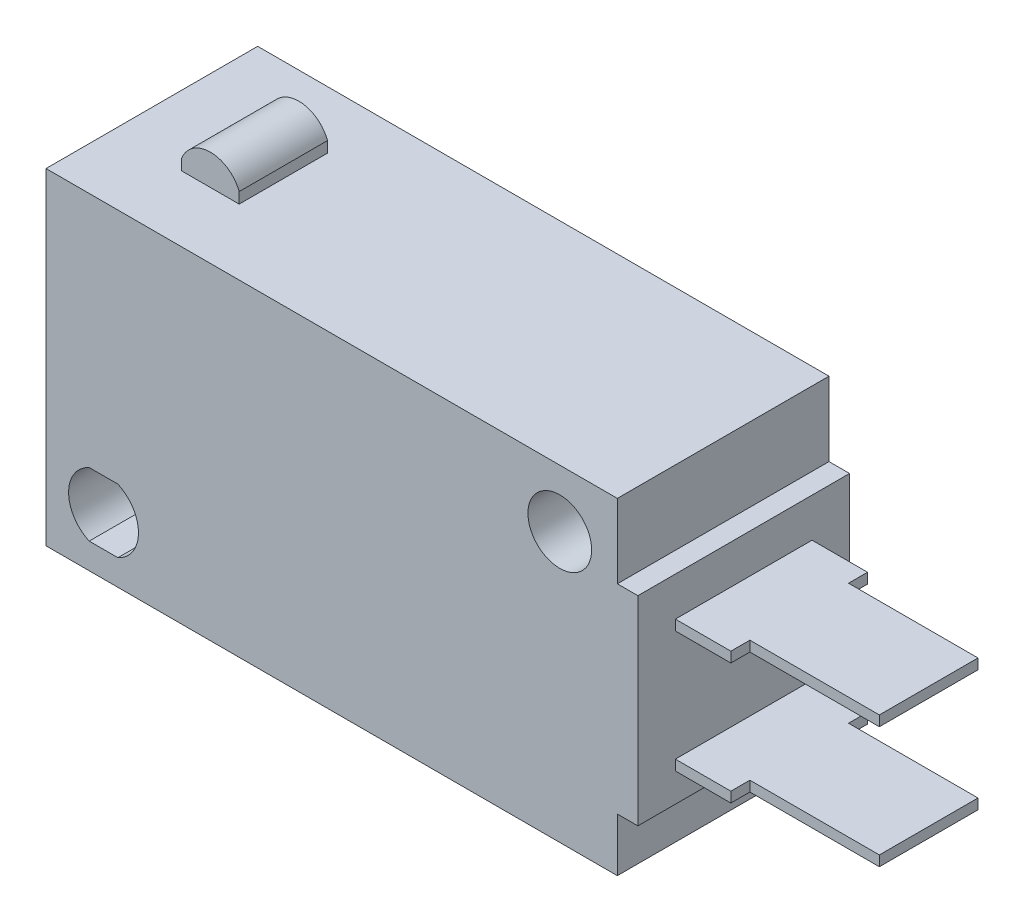
ISO-10303-21;
HEADER;
FILE_DESCRIPTION(('STEP AP214'),'2;1');
FILE_NAME('part.step','',(''),(''),'','','');
FILE_SCHEMA(('AUTOMOTIVE_DESIGN { 1 0 10303 214 1 1 1 1 }'));
ENDSEC;
DATA;
#1=APPLICATION_CONTEXT('core data for automotive mechanical design processes');
#2=APPLICATION_PROTOCOL_DEFINITION('international standard','automotive_design',2000,#1);
#3=PRODUCT_CONTEXT('',#1,'mechanical');
#4=PRODUCT('Part','Part','',(#3));
#5=PRODUCT_RELATED_PRODUCT_CATEGORY('part','',(#4));
#6=PRODUCT_DEFINITION_FORMATION('','',#4);
#7=PRODUCT_DEFINITION_CONTEXT('part definition',#1,'design');
#8=PRODUCT_DEFINITION('design','',#6,#7);
#9=PRODUCT_DEFINITION_SHAPE('','',#8);
#10=(LENGTH_UNIT() NAMED_UNIT(*) SI_UNIT(.MILLI.,.METRE.));
#11=(NAMED_UNIT(*) PLANE_ANGLE_UNIT() SI_UNIT($,.RADIAN.));
#12=(NAMED_UNIT(*) SI_UNIT($,.STERADIAN.) SOLID_ANGLE_UNIT());
#13=UNCERTAINTY_MEASURE_WITH_UNIT(LENGTH_MEASURE(1.E-05),#10,'distance_accuracy_value','');
#14=(GEOMETRIC_REPRESENTATION_CONTEXT(3) GLOBAL_UNCERTAINTY_ASSIGNED_CONTEXT((#13)) GLOBAL_UNIT_ASSIGNED_CONTEXT((#10,
#11,#12)) REPRESENTATION_CONTEXT('',''));
#15=CARTESIAN_POINT('',(0.,0.,0.));
#16=DIRECTION('',(0.,0.,1.));
#17=DIRECTION('',(1.,0.,0.));
#18=AXIS2_PLACEMENT_3D('',#15,#16,#17);
#19=CARTESIAN_POINT('',(3.8,-0.8,5.15));
#20=DIRECTION('',(-1.,0.,0.));
#21=DIRECTION('',(0.,-1.,0.));
#22=AXIS2_PLACEMENT_3D('',#19,#20,#21);
#23=PLANE('',#22);
#24=DIRECTION('',(0.,-1.,0.));
#25=VECTOR('',#24,1.);
#26=CARTESIAN_POINT('',(3.8,-2.7,3.325));
#27=LINE('',#26,#25);
#28=CARTESIAN_POINT('',(3.8,-2.7,3.325));
#29=VERTEX_POINT('',#28);
#30=CARTESIAN_POINT('',(3.8,-3.2,3.325));
#31=VERTEX_POINT('',#30);
#32=EDGE_CURVE('E393',#29,#31,#27,.T.);
#33=ORIENTED_EDGE('',*,*,#32,.F.);
#34=DIRECTION('',(0.,0.,1.));
#35=VECTOR('',#34,1.);
#36=CARTESIAN_POINT('',(3.8,-2.7,3.325));
#37=LINE('',#36,#35);
#38=CARTESIAN_POINT('',(3.8,-2.7,-3.325));
#39=VERTEX_POINT('',#38);
#40=EDGE_CURVE('E402',#39,#29,#37,.T.);
#41=ORIENTED_EDGE('',*,*,#40,.F.);
#42=DIRECTION('',(0.,1.,0.));
#43=VECTOR('',#42,1.);
#44=CARTESIAN_POINT('',(3.8,-2.7,-3.325));
#45=LINE('',#44,#43);
#46=CARTESIAN_POINT('',(3.8,-3.2,-3.325));
#47=VERTEX_POINT('',#46);
#48=EDGE_CURVE('E399',#47,#39,#45,.T.);
#49=ORIENTED_EDGE('',*,*,#48,.F.);
#50=DIRECTION('',(0.,0.,-1.));
#51=VECTOR('',#50,1.);
#52=CARTESIAN_POINT('',(3.8,-3.2,3.325));
#53=LINE('',#52,#51);
#54=EDGE_CURVE('E396',#31,#47,#53,.T.);
#55=ORIENTED_EDGE('',*,*,#54,.F.);
#56=EDGE_LOOP('',(#33,#41,#49,#55));
#57=FACE_BOUND('',#56,.T.);
#58=DIRECTION('',(0.,1.,0.));
#59=VECTOR('',#58,1.);
#60=CARTESIAN_POINT('',(3.8,-0.8,-5.15));
#61=LINE('',#60,#59);
#62=CARTESIAN_POINT('',(3.8,-10.5,-5.15));
#63=VERTEX_POINT('',#62);
#64=CARTESIAN_POINT('',(3.8,-0.8,-5.15));
#65=VERTEX_POINT('',#64);
#66=EDGE_CURVE('E298',#63,#65,#61,.T.);
#67=ORIENTED_EDGE('',*,*,#66,.T.);
#68=DIRECTION('',(0.,0.,-1.));
#69=VECTOR('',#68,1.);
#70=CARTESIAN_POINT('',(3.8,-0.8,5.15));
#71=LINE('',#70,#69);
#72=CARTESIAN_POINT('',(3.8,-0.8,5.15));
#73=VERTEX_POINT('',#72);
#74=EDGE_CURVE('E332',#73,#65,#71,.T.);
#75=ORIENTED_EDGE('',*,*,#74,.F.);
#76=DIRECTION('',(0.,1.,0.));
#77=VECTOR('',#76,1.);
#78=CARTESIAN_POINT('',(3.8,-0.8,5.15));
#79=LINE('',#78,#77);
#80=CARTESIAN_POINT('',(3.8,-10.5,5.15));
#81=VERTEX_POINT('',#80);
#82=EDGE_CURVE('E315',#81,#73,#79,.T.);
#83=ORIENTED_EDGE('',*,*,#82,.F.);
#84=DIRECTION('',(0.,0.,-1.));
#85=VECTOR('',#84,1.);
#86=CARTESIAN_POINT('',(3.8,-10.5,5.15));
#87=LINE('',#86,#85);
#88=EDGE_CURVE('E335',#81,#63,#87,.T.);
#89=ORIENTED_EDGE('',*,*,#88,.T.);
#90=EDGE_LOOP('',(#67,#75,#83,#89));
#91=FACE_BOUND('',#90,.T.);
#92=DIRECTION('',(0.,-1.,0.));
#93=VECTOR('',#92,1.);
#94=CARTESIAN_POINT('',(3.8,-8.6,3.325));
#95=LINE('',#94,#93);
#96=CARTESIAN_POINT('',(3.8,-8.6,3.325));
#97=VERTEX_POINT('',#96);
#98=CARTESIAN_POINT('',(3.8,-9.1,3.325));
#99=VERTEX_POINT('',#98);
#100=EDGE_CURVE('E917',#97,#99,#95,.T.);
#101=ORIENTED_EDGE('',*,*,#100,.F.);
#102=DIRECTION('',(0.,0.,1.));
#103=VECTOR('',#102,1.);
#104=CARTESIAN_POINT('',(3.8,-8.6,3.325));
#105=LINE('',#104,#103);
#106=CARTESIAN_POINT('',(3.8,-8.6,-3.325));
#107=VERTEX_POINT('',#106);
#108=EDGE_CURVE('E377',#107,#97,#105,.T.);
#109=ORIENTED_EDGE('',*,*,#108,.F.);
#110=DIRECTION('',(0.,1.,0.));
#111=VECTOR('',#110,1.);
#112=CARTESIAN_POINT('',(3.8,-8.6,-3.325));
#113=LINE('',#112,#111);
#114=CARTESIAN_POINT('',(3.8,-9.1,-3.325));
#115=VERTEX_POINT('',#114);
#116=EDGE_CURVE('E382',#115,#107,#113,.T.);
#117=ORIENTED_EDGE('',*,*,#116,.F.);
#118=DIRECTION('',(0.,0.,-1.));
#119=VECTOR('',#118,1.);
#120=CARTESIAN_POINT('',(3.8,-9.1,3.325));
#121=LINE('',#120,#119);
#122=EDGE_CURVE('E920',#99,#115,#121,.T.);
#123=ORIENTED_EDGE('',*,*,#122,.F.);
#124=EDGE_LOOP('',(#101,#109,#117,#123));
#125=FACE_BOUND('',#124,.T.);
#126=ADVANCED_FACE('F15',(#57,#91,#125),#23,.F.);
#127=CARTESIAN_POINT('',(-25.,2.8,5.15));
#128=DIRECTION('',(0.,-1.,0.));
#129=DIRECTION('',(0.,0.,-1.));
#130=AXIS2_PLACEMENT_3D('',#127,#128,#129);
#131=PLANE('',#130);
#132=DIRECTION('',(-1.,0.,0.));
#133=VECTOR('',#132,1.);
#134=CARTESIAN_POINT('',(-25.,2.8,-5.15));
#135=LINE('',#134,#133);
#136=CARTESIAN_POINT('',(2.8,2.8,-5.15));
#137=VERTEX_POINT('',#136);
#138=CARTESIAN_POINT('',(-25.,2.8,-5.15));
#139=VERTEX_POINT('',#138);
#140=EDGE_CURVE('E304',#137,#139,#135,.T.);
#141=ORIENTED_EDGE('',*,*,#140,.T.);
#142=DIRECTION('',(0.,0.,-1.));
#143=VECTOR('',#142,1.);
#144=CARTESIAN_POINT('',(-25.,2.8,5.15));
#145=LINE('',#144,#143);
#146=CARTESIAN_POINT('',(-25.,2.8,5.15));
#147=VERTEX_POINT('',#146);
#148=EDGE_CURVE('E323',#147,#139,#145,.T.);
#149=ORIENTED_EDGE('',*,*,#148,.F.);
#150=DIRECTION('',(-1.,0.,0.));
#151=VECTOR('',#150,1.);
#152=CARTESIAN_POINT('',(-25.,2.8,5.15));
#153=LINE('',#152,#151);
#154=CARTESIAN_POINT('',(2.8,2.8,5.15));
#155=VERTEX_POINT('',#154);
#156=EDGE_CURVE('E321',#155,#147,#153,.T.);
#157=ORIENTED_EDGE('',*,*,#156,.F.);
#158=DIRECTION('',(0.,0.,-1.));
#159=VECTOR('',#158,1.);
#160=CARTESIAN_POINT('',(2.8,2.8,5.15));
#161=LINE('',#160,#159);
#162=EDGE_CURVE('E326',#155,#137,#161,.T.);
#163=ORIENTED_EDGE('',*,*,#162,.T.);
#164=EDGE_LOOP('',(#141,#149,#157,#163));
#165=FACE_BOUND('',#164,.T.);
#166=DIRECTION('',(0.,0.,1.));
#167=VECTOR('',#166,1.);
#168=CARTESIAN_POINT('',(-21.6,2.8,-2.35));
#169=LINE('',#168,#167);
#170=CARTESIAN_POINT('',(-21.6,2.8,-2.35));
#171=VERTEX_POINT('',#170);
#172=CARTESIAN_POINT('',(-21.6,2.8,1.95));
#173=VERTEX_POINT('',#172);
#174=EDGE_CURVE('E418',#171,#173,#169,.T.);
#175=ORIENTED_EDGE('',*,*,#174,.F.);
#176=DIRECTION('',(-1.,0.,0.));
#177=VECTOR('',#176,1.);
#178=CARTESIAN_POINT('',(-21.6,2.8,-2.35));
#179=LINE('',#178,#177);
#180=CARTESIAN_POINT('',(-18.8,2.8,-2.35));
#181=VERTEX_POINT('',#180);
#182=EDGE_CURVE('E424',#181,#171,#179,.T.);
#183=ORIENTED_EDGE('',*,*,#182,.F.);
#184=DIRECTION('',(0.,0.,-1.));
#185=VECTOR('',#184,1.);
#186=CARTESIAN_POINT('',(-18.8,2.8,-2.35));
#187=LINE('',#186,#185);
#188=CARTESIAN_POINT('',(-18.8,2.8,1.95));
#189=VERTEX_POINT('',#188);
#190=EDGE_CURVE('E422',#189,#181,#187,.T.);
#191=ORIENTED_EDGE('',*,*,#190,.F.);
#192=DIRECTION('',(1.,0.,0.));
#193=VECTOR('',#192,1.);
#194=CARTESIAN_POINT('',(-21.6,2.8,1.95));
#195=LINE('',#194,#193);
#196=EDGE_CURVE('E244',#173,#189,#195,.T.);
#197=ORIENTED_EDGE('',*,*,#196,.F.);
#198=EDGE_LOOP('',(#175,#183,#191,#197));
#199=FACE_BOUND('',#198,.T.);
#200=ADVANCED_FACE('F431',(#165,#199),#131,.F.);
#201=CARTESIAN_POINT('',(-25.,-13.1,5.15));
#202=DIRECTION('',(0.,0.,1.));
#203=DIRECTION('',(1.,0.,0.));
#204=AXIS2_PLACEMENT_3D('',#201,#202,#203);
#205=PLANE('',#204);
#206=CARTESIAN_POINT('',(0.,0.,5.15));
#207=DIRECTION('',(0.,0.,1.));
#208=DIRECTION('',(1.,0.,0.));
#209=AXIS2_PLACEMENT_3D('',#206,#207,#208);
#210=CIRCLE('',#209,1.55);
#211=CARTESIAN_POINT('',(1.55,0.,5.15));
#212=VERTEX_POINT('',#211);
#213=EDGE_CURVE('E286',#212,#212,#210,.T.);
#214=ORIENTED_EDGE('',*,*,#213,.F.);
#215=EDGE_LOOP('',(#214));
#216=FACE_BOUND('',#215,.T.);
#217=DIRECTION('',(0.,-1.,0.));
#218=VECTOR('',#217,1.);
#219=CARTESIAN_POINT('',(-25.,2.8,5.15));
#220=LINE('',#219,#218);
#221=CARTESIAN_POINT('',(-25.,-13.1,5.15));
#222=VERTEX_POINT('',#221);
#223=EDGE_CURVE('E306',#147,#222,#220,.T.);
#224=ORIENTED_EDGE('',*,*,#223,.T.);
#225=DIRECTION('',(1.,0.,0.));
#226=VECTOR('',#225,1.);
#227=CARTESIAN_POINT('',(-25.,-13.1,5.15));
#228=LINE('',#227,#226);
#229=CARTESIAN_POINT('',(2.8,-13.1,5.15));
#230=VERTEX_POINT('',#229);
#231=EDGE_CURVE('E309',#222,#230,#228,.T.);
#232=ORIENTED_EDGE('',*,*,#231,.T.);
#233=DIRECTION('',(0.,1.,0.));
#234=VECTOR('',#233,1.);
#235=CARTESIAN_POINT('',(2.8,-10.5,5.15));
#236=LINE('',#235,#234);
#237=CARTESIAN_POINT('',(2.8,-10.5,5.15));
#238=VERTEX_POINT('',#237);
#239=EDGE_CURVE('E311',#230,#238,#236,.T.);
#240=ORIENTED_EDGE('',*,*,#239,.T.);
#241=DIRECTION('',(1.,0.,0.));
#242=VECTOR('',#241,1.);
#243=CARTESIAN_POINT('',(3.8,-10.5,5.15));
#244=LINE('',#243,#242);
#245=EDGE_CURVE('E313',#238,#81,#244,.T.);
#246=ORIENTED_EDGE('',*,*,#245,.T.);
#247=ORIENTED_EDGE('',*,*,#82,.T.);
#248=DIRECTION('',(-1.,0.,0.));
#249=VECTOR('',#248,1.);
#250=CARTESIAN_POINT('',(2.8,-0.8,5.15));
#251=LINE('',#250,#249);
#252=CARTESIAN_POINT('',(2.8,-0.8,5.15));
#253=VERTEX_POINT('',#252);
#254=EDGE_CURVE('E317',#73,#253,#251,.T.);
#255=ORIENTED_EDGE('',*,*,#254,.T.);
#256=DIRECTION('',(0.,1.,0.));
#257=VECTOR('',#256,1.);
#258=CARTESIAN_POINT('',(2.8,2.8,5.15));
#259=LINE('',#258,#257);
#260=EDGE_CURVE('E319',#253,#155,#259,.T.);
#261=ORIENTED_EDGE('',*,*,#260,.T.);
#262=ORIENTED_EDGE('',*,*,#156,.T.);
#263=EDGE_LOOP('',(#224,#232,#240,#246,#247,#255,#261,#262));
#264=FACE_BOUND('',#263,.T.);
#265=DIRECTION('',(1.,0.,0.));
#266=VECTOR('',#265,1.);
#267=CARTESIAN_POINT('',(-22.8982120021885,-11.85,5.15));
#268=LINE('',#267,#266);
#269=CARTESIAN_POINT('',(-22.8982120021885,-11.85,5.15));
#270=VERTEX_POINT('',#269);
#271=CARTESIAN_POINT('',(-21.5017879978116,-11.85,5.15));
#272=VERTEX_POINT('',#271);
#273=EDGE_CURVE('E266',#270,#272,#268,.T.);
#274=ORIENTED_EDGE('',*,*,#273,.F.);
#275=CARTESIAN_POINT('',(-22.2,-10.3,5.15));
#276=DIRECTION('',(0.,0.,1.));
#277=DIRECTION('',(1.,0.,0.));
#278=AXIS2_PLACEMENT_3D('',#275,#276,#277);
#279=CIRCLE('',#278,1.7);
#280=CARTESIAN_POINT('',(-22.8982120021885,-8.75,5.15));
#281=VERTEX_POINT('',#280);
#282=EDGE_CURVE('E264',#281,#270,#279,.T.);
#283=ORIENTED_EDGE('',*,*,#282,.F.);
#284=DIRECTION('',(-1.,0.,0.));
#285=VECTOR('',#284,1.);
#286=CARTESIAN_POINT('',(-22.8982120021885,-8.75,5.15));
#287=LINE('',#286,#285);
#288=CARTESIAN_POINT('',(-21.5017879978116,-8.75,5.15));
#289=VERTEX_POINT('',#288);
#290=EDGE_CURVE('E271',#289,#281,#287,.T.);
#291=ORIENTED_EDGE('',*,*,#290,.F.);
#292=CARTESIAN_POINT('',(-22.2,-10.3,5.15));
#293=DIRECTION('',(0.,0.,1.));
#294=DIRECTION('',(1.,0.,0.));
#295=AXIS2_PLACEMENT_3D('',#292,#293,#294);
#296=CIRCLE('',#295,1.7);
#297=EDGE_CURVE('E268',#272,#289,#296,.T.);
#298=ORIENTED_EDGE('',*,*,#297,.F.);
#299=EDGE_LOOP('',(#274,#283,#291,#298));
#300=FACE_BOUND('',#299,.T.);
#301=ADVANCED_FACE('F451',(#216,#264,#300),#205,.T.);
#302=CARTESIAN_POINT('',(-25.,-13.1,-5.15));
#303=DIRECTION('',(0.,0.,1.));
#304=DIRECTION('',(1.,0.,0.));
#305=AXIS2_PLACEMENT_3D('',#302,#303,#304);
#306=PLANE('',#305);
#307=CARTESIAN_POINT('',(0.,0.,-5.15));
#308=DIRECTION('',(0.,0.,1.));
#309=DIRECTION('',(1.,0.,0.));
#310=AXIS2_PLACEMENT_3D('',#307,#308,#309);
#311=CIRCLE('',#310,1.55);
#312=CARTESIAN_POINT('',(1.55,0.,-5.15));
#313=VERTEX_POINT('',#312);
#314=EDGE_CURVE('E283',#313,#313,#311,.T.);
#315=ORIENTED_EDGE('',*,*,#314,.T.);
#316=EDGE_LOOP('',(#315));
#317=FACE_BOUND('',#316,.T.);
#318=DIRECTION('',(0.,-1.,0.));
#319=VECTOR('',#318,1.);
#320=CARTESIAN_POINT('',(-25.,2.8,-5.15));
#321=LINE('',#320,#319);
#322=CARTESIAN_POINT('',(-25.,-13.1,-5.15));
#323=VERTEX_POINT('',#322);
#324=EDGE_CURVE('E289',#139,#323,#321,.T.);
#325=ORIENTED_EDGE('',*,*,#324,.F.);
#326=ORIENTED_EDGE('',*,*,#140,.F.);
#327=DIRECTION('',(0.,1.,0.));
#328=VECTOR('',#327,1.);
#329=CARTESIAN_POINT('',(2.8,2.8,-5.15));
#330=LINE('',#329,#328);
#331=CARTESIAN_POINT('',(2.8,-0.8,-5.15));
#332=VERTEX_POINT('',#331);
#333=EDGE_CURVE('E302',#332,#137,#330,.T.);
#334=ORIENTED_EDGE('',*,*,#333,.F.);
#335=DIRECTION('',(-1.,0.,0.));
#336=VECTOR('',#335,1.);
#337=CARTESIAN_POINT('',(2.8,-0.8,-5.15));
#338=LINE('',#337,#336);
#339=EDGE_CURVE('E300',#65,#332,#338,.T.);
#340=ORIENTED_EDGE('',*,*,#339,.F.);
#341=ORIENTED_EDGE('',*,*,#66,.F.);
#342=DIRECTION('',(1.,0.,0.));
#343=VECTOR('',#342,1.);
#344=CARTESIAN_POINT('',(3.8,-10.5,-5.15));
#345=LINE('',#344,#343);
#346=CARTESIAN_POINT('',(2.8,-10.5,-5.15));
#347=VERTEX_POINT('',#346);
#348=EDGE_CURVE('E296',#347,#63,#345,.T.);
#349=ORIENTED_EDGE('',*,*,#348,.F.);
#350=DIRECTION('',(0.,1.,0.));
#351=VECTOR('',#350,1.);
#352=CARTESIAN_POINT('',(2.8,-10.5,-5.15));
#353=LINE('',#352,#351);
#354=CARTESIAN_POINT('',(2.8,-13.1,-5.15));
#355=VERTEX_POINT('',#354);
#356=EDGE_CURVE('E294',#355,#347,#353,.T.);
#357=ORIENTED_EDGE('',*,*,#356,.F.);
#358=DIRECTION('',(1.,0.,0.));
#359=VECTOR('',#358,1.);
#360=CARTESIAN_POINT('',(-25.,-13.1,-5.15));
#361=LINE('',#360,#359);
#362=EDGE_CURVE('E292',#323,#355,#361,.T.);
#363=ORIENTED_EDGE('',*,*,#362,.F.);
#364=EDGE_LOOP('',(#325,#326,#334,#340,#341,#349,#357,#363));
#365=FACE_BOUND('',#364,.T.);
#366=CARTESIAN_POINT('',(-22.2,-10.3,-5.15));
#367=DIRECTION('',(0.,0.,1.));
#368=DIRECTION('',(1.,0.,0.));
#369=AXIS2_PLACEMENT_3D('',#366,#367,#368);
#370=CIRCLE('',#369,1.7);
#371=CARTESIAN_POINT('',(-22.8982120021885,-8.75,-5.15));
#372=VERTEX_POINT('',#371);
#373=CARTESIAN_POINT('',(-22.8982120021885,-11.85,-5.15));
#374=VERTEX_POINT('',#373);
#375=EDGE_CURVE('E247',#372,#374,#370,.T.);
#376=ORIENTED_EDGE('',*,*,#375,.T.);
#377=DIRECTION('',(1.,0.,0.));
#378=VECTOR('',#377,1.);
#379=CARTESIAN_POINT('',(-22.8982120021885,-11.85,-5.15));
#380=LINE('',#379,#378);
#381=CARTESIAN_POINT('',(-21.5017879978116,-11.85,-5.15));
#382=VERTEX_POINT('',#381);
#383=EDGE_CURVE('E255',#374,#382,#380,.T.);
#384=ORIENTED_EDGE('',*,*,#383,.T.);
#385=CARTESIAN_POINT('',(-22.2,-10.3,-5.15));
#386=DIRECTION('',(0.,0.,1.));
#387=DIRECTION('',(1.,0.,0.));
#388=AXIS2_PLACEMENT_3D('',#385,#386,#387);
#389=CIRCLE('',#388,1.7);
#390=CARTESIAN_POINT('',(-21.5017879978116,-8.75,-5.15));
#391=VERTEX_POINT('',#390);
#392=EDGE_CURVE('E258',#382,#391,#389,.T.);
#393=ORIENTED_EDGE('',*,*,#392,.T.);
#394=DIRECTION('',(-1.,0.,0.));
#395=VECTOR('',#394,1.);
#396=CARTESIAN_POINT('',(-22.8982120021885,-8.75,-5.15));
#397=LINE('',#396,#395);
#398=EDGE_CURVE('E261',#391,#372,#397,.T.);
#399=ORIENTED_EDGE('',*,*,#398,.T.);
#400=EDGE_LOOP('',(#376,#384,#393,#399));
#401=FACE_BOUND('',#400,.T.);
#402=ADVANCED_FACE('F473',(#317,#365,#401),#306,.F.);
#403=CARTESIAN_POINT('',(-25.,2.8,5.15));
#404=DIRECTION('',(1.,0.,0.));
#405=DIRECTION('',(0.,0.,-1.));
#406=AXIS2_PLACEMENT_3D('',#403,#404,#405);
#407=PLANE('',#406);
#408=ORIENTED_EDGE('',*,*,#324,.T.);
#409=DIRECTION('',(0.,0.,-1.));
#410=VECTOR('',#409,1.);
#411=CARTESIAN_POINT('',(-25.,-13.1,5.15));
#412=LINE('',#411,#410);
#413=EDGE_CURVE('E344',#222,#323,#412,.T.);
#414=ORIENTED_EDGE('',*,*,#413,.F.);
#415=ORIENTED_EDGE('',*,*,#223,.F.);
#416=ORIENTED_EDGE('',*,*,#148,.T.);
#417=EDGE_LOOP('',(#408,#414,#415,#416));
#418=FACE_BOUND('',#417,.T.);
#419=ADVANCED_FACE('F17',(#418),#407,.F.);
#420=CARTESIAN_POINT('',(-25.,-13.1,5.15));
#421=DIRECTION('',(0.,1.,0.));
#422=DIRECTION('',(0.,0.,1.));
#423=AXIS2_PLACEMENT_3D('',#420,#421,#422);
#424=PLANE('',#423);
#425=ORIENTED_EDGE('',*,*,#362,.T.);
#426=DIRECTION('',(0.,0.,-1.));
#427=VECTOR('',#426,1.);
#428=CARTESIAN_POINT('',(2.8,-13.1,5.15));
#429=LINE('',#428,#427);
#430=EDGE_CURVE('E341',#230,#355,#429,.T.);
#431=ORIENTED_EDGE('',*,*,#430,.F.);
#432=ORIENTED_EDGE('',*,*,#231,.F.);
#433=ORIENTED_EDGE('',*,*,#413,.T.);
#434=EDGE_LOOP('',(#425,#431,#432,#433));
#435=FACE_BOUND('',#434,.T.);
#436=ADVANCED_FACE('F466',(#435),#424,.F.);
#437=CARTESIAN_POINT('',(2.8,-10.5,5.15));
#438=DIRECTION('',(-1.,0.,0.));
#439=DIRECTION('',(0.,0.,1.));
#440=AXIS2_PLACEMENT_3D('',#437,#438,#439);
#441=PLANE('',#440);
#442=ORIENTED_EDGE('',*,*,#356,.T.);
#443=DIRECTION('',(0.,0.,-1.));
#444=VECTOR('',#443,1.);
#445=CARTESIAN_POINT('',(2.8,-10.5,5.15));
#446=LINE('',#445,#444);
#447=EDGE_CURVE('E338',#238,#347,#446,.T.);
#448=ORIENTED_EDGE('',*,*,#447,.F.);
#449=ORIENTED_EDGE('',*,*,#239,.F.);
#450=ORIENTED_EDGE('',*,*,#430,.T.);
#451=EDGE_LOOP('',(#442,#448,#449,#450));
#452=FACE_BOUND('',#451,.T.);
#453=ADVANCED_FACE('F463',(#452),#441,.F.);
#454=CARTESIAN_POINT('',(3.8,-10.5,5.15));
#455=DIRECTION('',(0.,1.,0.));
#456=DIRECTION('',(0.,0.,1.));
#457=AXIS2_PLACEMENT_3D('',#454,#455,#456);
#458=PLANE('',#457);
#459=ORIENTED_EDGE('',*,*,#348,.T.);
#460=ORIENTED_EDGE('',*,*,#88,.F.);
#461=ORIENTED_EDGE('',*,*,#245,.F.);
#462=ORIENTED_EDGE('',*,*,#447,.T.);
#463=EDGE_LOOP('',(#459,#460,#461,#462));
#464=FACE_BOUND('',#463,.T.);
#465=ADVANCED_FACE('F460',(#464),#458,.F.);
#466=CARTESIAN_POINT('',(2.8,-0.8,5.15));
#467=DIRECTION('',(0.,-1.,0.));
#468=DIRECTION('',(0.,0.,-1.));
#469=AXIS2_PLACEMENT_3D('',#466,#467,#468);
#470=PLANE('',#469);
#471=ORIENTED_EDGE('',*,*,#339,.T.);
#472=DIRECTION('',(0.,0.,-1.));
#473=VECTOR('',#472,1.);
#474=CARTESIAN_POINT('',(2.8,-0.8,5.15));
#475=LINE('',#474,#473);
#476=EDGE_CURVE('E329',#253,#332,#475,.T.);
#477=ORIENTED_EDGE('',*,*,#476,.F.);
#478=ORIENTED_EDGE('',*,*,#254,.F.);
#479=ORIENTED_EDGE('',*,*,#74,.T.);
#480=EDGE_LOOP('',(#471,#477,#478,#479));
#481=FACE_BOUND('',#480,.T.);
#482=ADVANCED_FACE('F458',(#481),#470,.F.);
#483=CARTESIAN_POINT('',(2.8,2.8,5.15));
#484=DIRECTION('',(-1.,0.,0.));
#485=DIRECTION('',(0.,0.,1.));
#486=AXIS2_PLACEMENT_3D('',#483,#484,#485);
#487=PLANE('',#486);
#488=ORIENTED_EDGE('',*,*,#333,.T.);
#489=ORIENTED_EDGE('',*,*,#162,.F.);
#490=ORIENTED_EDGE('',*,*,#260,.F.);
#491=ORIENTED_EDGE('',*,*,#476,.T.);
#492=EDGE_LOOP('',(#488,#489,#490,#491));
#493=FACE_BOUND('',#492,.T.);
#494=ADVANCED_FACE('F503',(#493),#487,.F.);
#495=CARTESIAN_POINT('',(0.,0.,5.15));
#496=DIRECTION('',(0.,0.,-1.));
#497=DIRECTION('',(-1.,0.,0.));
#498=AXIS2_PLACEMENT_3D('',#495,#496,#497);
#499=CYLINDRICAL_SURFACE('',#498,1.55);
#500=ORIENTED_EDGE('',*,*,#213,.T.);
#501=EDGE_LOOP('',(#500));
#502=FACE_BOUND('',#501,.T.);
#503=ORIENTED_EDGE('',*,*,#314,.F.);
#504=EDGE_LOOP('',(#503));
#505=FACE_BOUND('',#504,.T.);
#506=ADVANCED_FACE('F509',(#502,#505),#499,.F.);
#507=CARTESIAN_POINT('',(-22.2,-10.3,5.15));
#508=DIRECTION('',(0.,0.,-1.));
#509=DIRECTION('',(-1.,0.,0.));
#510=AXIS2_PLACEMENT_3D('',#507,#508,#509);
#511=CYLINDRICAL_SURFACE('',#510,1.7);
#512=ORIENTED_EDGE('',*,*,#375,.F.);
#513=DIRECTION('',(0.,0.,-1.));
#514=VECTOR('',#513,1.);
#515=CARTESIAN_POINT('',(-22.8982120021885,-8.75,5.15));
#516=LINE('',#515,#514);
#517=EDGE_CURVE('E273',#281,#372,#516,.T.);
#518=ORIENTED_EDGE('',*,*,#517,.F.);
#519=ORIENTED_EDGE('',*,*,#282,.T.);
#520=DIRECTION('',(0.,0.,-1.));
#521=VECTOR('',#520,1.);
#522=CARTESIAN_POINT('',(-22.8982120021885,-11.85,5.15));
#523=LINE('',#522,#521);
#524=EDGE_CURVE('E280',#270,#374,#523,.T.);
#525=ORIENTED_EDGE('',*,*,#524,.T.);
#526=EDGE_LOOP('',(#512,#518,#519,#525));
#527=FACE_BOUND('',#526,.T.);
#528=ADVANCED_FACE('F513',(#527),#511,.F.);
#529=CARTESIAN_POINT('',(-22.8982120021885,-11.85,5.15));
#530=DIRECTION('',(0.,1.,0.));
#531=DIRECTION('',(0.,0.,1.));
#532=AXIS2_PLACEMENT_3D('',#529,#530,#531);
#533=PLANE('',#532);
#534=ORIENTED_EDGE('',*,*,#383,.F.);
#535=ORIENTED_EDGE('',*,*,#524,.F.);
#536=ORIENTED_EDGE('',*,*,#273,.T.);
#537=DIRECTION('',(0.,0.,-1.));
#538=VECTOR('',#537,1.);
#539=CARTESIAN_POINT('',(-21.5017879978116,-11.85,5.15));
#540=LINE('',#539,#538);
#541=EDGE_CURVE('E278',#272,#382,#540,.T.);
#542=ORIENTED_EDGE('',*,*,#541,.T.);
#543=EDGE_LOOP('',(#534,#535,#536,#542));
#544=FACE_BOUND('',#543,.T.);
#545=ADVANCED_FACE('F525',(#544),#533,.T.);
#546=CARTESIAN_POINT('',(-22.2,-10.3,5.15));
#547=DIRECTION('',(0.,0.,-1.));
#548=DIRECTION('',(-1.,0.,0.));
#549=AXIS2_PLACEMENT_3D('',#546,#547,#548);
#550=CYLINDRICAL_SURFACE('',#549,1.7);
#551=ORIENTED_EDGE('',*,*,#392,.F.);
#552=ORIENTED_EDGE('',*,*,#541,.F.);
#553=ORIENTED_EDGE('',*,*,#297,.T.);
#554=DIRECTION('',(0.,0.,-1.));
#555=VECTOR('',#554,1.);
#556=CARTESIAN_POINT('',(-21.5017879978116,-8.75,5.15));
#557=LINE('',#556,#555);
#558=EDGE_CURVE('E276',#289,#391,#557,.T.);
#559=ORIENTED_EDGE('',*,*,#558,.T.);
#560=EDGE_LOOP('',(#551,#552,#553,#559));
#561=FACE_BOUND('',#560,.T.);
#562=ADVANCED_FACE('F529',(#561),#550,.F.);
#563=CARTESIAN_POINT('',(-22.8982120021885,-8.75,5.15));
#564=DIRECTION('',(0.,-1.,0.));
#565=DIRECTION('',(0.,0.,-1.));
#566=AXIS2_PLACEMENT_3D('',#563,#564,#565);
#567=PLANE('',#566);
#568=ORIENTED_EDGE('',*,*,#398,.F.);
#569=ORIENTED_EDGE('',*,*,#558,.F.);
#570=ORIENTED_EDGE('',*,*,#290,.T.);
#571=ORIENTED_EDGE('',*,*,#517,.T.);
#572=EDGE_LOOP('',(#568,#569,#570,#571));
#573=FACE_BOUND('',#572,.T.);
#574=ADVANCED_FACE('F533',(#573),#567,.T.);
#575=CARTESIAN_POINT('',(-21.6,4.29,-2.35));
#576=DIRECTION('',(1.,0.,0.));
#577=DIRECTION('',(0.,0.,-1.));
#578=AXIS2_PLACEMENT_3D('',#575,#576,#577);
#579=PLANE('',#578);
#580=DIRECTION('',(0.,-1.,0.));
#581=VECTOR('',#580,1.);
#582=CARTESIAN_POINT('',(-21.6,4.29,1.95));
#583=LINE('',#582,#581);
#584=CARTESIAN_POINT('',(-21.6,3.32851648071344,1.95));
#585=VERTEX_POINT('',#584);
#586=EDGE_CURVE('E245',#585,#173,#583,.T.);
#587=ORIENTED_EDGE('',*,*,#586,.F.);
#588=DIRECTION('',(0.,0.,1.));
#589=VECTOR('',#588,1.);
#590=CARTESIAN_POINT('',(-21.6,3.32851648071344,-5.15));
#591=LINE('',#590,#589);
#592=CARTESIAN_POINT('',(-21.6,3.32851648071344,-2.35));
#593=VERTEX_POINT('',#592);
#594=EDGE_CURVE('E229',#593,#585,#591,.T.);
#595=ORIENTED_EDGE('',*,*,#594,.F.);
#596=DIRECTION('',(0.,-1.,0.));
#597=VECTOR('',#596,1.);
#598=CARTESIAN_POINT('',(-21.6,4.29,-2.35));
#599=LINE('',#598,#597);
#600=EDGE_CURVE('E249',#593,#171,#599,.T.);
#601=ORIENTED_EDGE('',*,*,#600,.T.);
#602=ORIENTED_EDGE('',*,*,#174,.T.);
#603=EDGE_LOOP('',(#587,#595,#601,#602));
#604=FACE_BOUND('',#603,.T.);
#605=ADVANCED_FACE('F428',(#604),#579,.F.);
#606=CARTESIAN_POINT('',(-21.6,4.29,1.95));
#607=DIRECTION('',(0.,0.,-1.));
#608=DIRECTION('',(-1.,0.,0.));
#609=AXIS2_PLACEMENT_3D('',#606,#607,#608);
#610=PLANE('',#609);
#611=DIRECTION('',(0.,-1.,0.));
#612=VECTOR('',#611,1.);
#613=CARTESIAN_POINT('',(-18.8,4.29,1.95));
#614=LINE('',#613,#612);
#615=CARTESIAN_POINT('',(-18.8,3.32851648071344,1.95));
#616=VERTEX_POINT('',#615);
#617=EDGE_CURVE('E237',#616,#189,#614,.T.);
#618=ORIENTED_EDGE('',*,*,#617,.F.);
#619=CARTESIAN_POINT('',(-20.2,2.79,1.95));
#620=DIRECTION('',(0.,0.,-1.));
#621=DIRECTION('',(-1.,0.,0.));
#622=AXIS2_PLACEMENT_3D('',#619,#620,#621);
#623=CIRCLE('',#622,1.5);
#624=EDGE_CURVE('E223',#585,#616,#623,.T.);
#625=ORIENTED_EDGE('',*,*,#624,.F.);
#626=ORIENTED_EDGE('',*,*,#586,.T.);
#627=ORIENTED_EDGE('',*,*,#196,.T.);
#628=EDGE_LOOP('',(#618,#625,#626,#627));
#629=FACE_BOUND('',#628,.T.);
#630=ADVANCED_FACE('F242',(#629),#610,.F.);
#631=CARTESIAN_POINT('',(-18.8,4.29,-2.35));
#632=DIRECTION('',(-1.,0.,0.));
#633=DIRECTION('',(0.,0.,1.));
#634=AXIS2_PLACEMENT_3D('',#631,#632,#633);
#635=PLANE('',#634);
#636=DIRECTION('',(0.,-1.,0.));
#637=VECTOR('',#636,1.);
#638=CARTESIAN_POINT('',(-18.8,4.29,-2.35));
#639=LINE('',#638,#637);
#640=CARTESIAN_POINT('',(-18.8,3.32851648071344,-2.35));
#641=VERTEX_POINT('',#640);
#642=EDGE_CURVE('E239',#641,#181,#639,.T.);
#643=ORIENTED_EDGE('',*,*,#642,.F.);
#644=DIRECTION('',(0.,0.,1.));
#645=VECTOR('',#644,1.);
#646=CARTESIAN_POINT('',(-18.8,3.32851648071344,-5.15));
#647=LINE('',#646,#645);
#648=EDGE_CURVE('E226',#641,#616,#647,.T.);
#649=ORIENTED_EDGE('',*,*,#648,.T.);
#650=ORIENTED_EDGE('',*,*,#617,.T.);
#651=ORIENTED_EDGE('',*,*,#190,.T.);
#652=EDGE_LOOP('',(#643,#649,#650,#651));
#653=FACE_BOUND('',#652,.T.);
#654=ADVANCED_FACE('F235',(#653),#635,.F.);
#655=CARTESIAN_POINT('',(-21.6,4.29,-2.35));
#656=DIRECTION('',(0.,0.,1.));
#657=DIRECTION('',(1.,0.,0.));
#658=AXIS2_PLACEMENT_3D('',#655,#656,#657);
#659=PLANE('',#658);
#660=ORIENTED_EDGE('',*,*,#600,.F.);
#661=CARTESIAN_POINT('',(-20.2,2.79,-2.35));
#662=DIRECTION('',(0.,0.,1.));
#663=DIRECTION('',(1.,0.,0.));
#664=AXIS2_PLACEMENT_3D('',#661,#662,#663);
#665=CIRCLE('',#664,1.5);
#666=EDGE_CURVE('E30',#593,#641,#665,.F.);
#667=ORIENTED_EDGE('',*,*,#666,.T.);
#668=ORIENTED_EDGE('',*,*,#642,.T.);
#669=ORIENTED_EDGE('',*,*,#182,.T.);
#670=EDGE_LOOP('',(#660,#667,#668,#669));
#671=FACE_BOUND('',#670,.T.);
#672=ADVANCED_FACE('F432',(#671),#659,.F.);
#673=CARTESIAN_POINT('',(12.8,-2.7,3.325));
#674=DIRECTION('',(0.,0.,-1.));
#675=DIRECTION('',(0.,1.,0.));
#676=AXIS2_PLACEMENT_3D('',#673,#674,#675);
#677=PLANE('',#676);
#678=DIRECTION('',(-1.,0.,0.));
#679=VECTOR('',#678,1.);
#680=CARTESIAN_POINT('',(12.8,-3.2,3.325));
#681=LINE('',#680,#679);
#682=CARTESIAN_POINT('',(6.5,-3.2,3.325));
#683=VERTEX_POINT('',#682);
#684=EDGE_CURVE('E416',#683,#31,#681,.T.);
#685=ORIENTED_EDGE('',*,*,#684,.F.);
#686=DIRECTION('',(0.,1.,0.));
#687=VECTOR('',#686,1.);
#688=CARTESIAN_POINT('',(6.5,-13.1,3.325));
#689=LINE('',#688,#687);
#690=CARTESIAN_POINT('',(6.5,-2.7,3.325));
#691=VERTEX_POINT('',#690);
#692=EDGE_CURVE('E894',#683,#691,#689,.T.);
#693=ORIENTED_EDGE('',*,*,#692,.T.);
#694=DIRECTION('',(-1.,0.,0.));
#695=VECTOR('',#694,1.);
#696=CARTESIAN_POINT('',(12.8,-2.7,3.325));
#697=LINE('',#696,#695);
#698=EDGE_CURVE('E410',#691,#29,#697,.T.);
#699=ORIENTED_EDGE('',*,*,#698,.T.);
#700=ORIENTED_EDGE('',*,*,#32,.T.);
#701=EDGE_LOOP('',(#685,#693,#699,#700));
#702=FACE_BOUND('',#701,.T.);
#703=ADVANCED_FACE('F434',(#702),#677,.F.);
#704=CARTESIAN_POINT('',(12.8,-3.2,3.325));
#705=DIRECTION('',(0.,1.,0.));
#706=DIRECTION('',(-1.,0.,0.));
#707=AXIS2_PLACEMENT_3D('',#704,#705,#706);
#708=PLANE('',#707);
#709=DIRECTION('',(0.,0.,1.));
#710=VECTOR('',#709,1.);
#711=CARTESIAN_POINT('',(6.5,-3.2,3.325));
#712=LINE('',#711,#710);
#713=CARTESIAN_POINT('',(6.5,-3.2,-3.325));
#714=VERTEX_POINT('',#713);
#715=CARTESIAN_POINT('',(6.5,-3.2,-2.4));
#716=VERTEX_POINT('',#715);
#717=EDGE_CURVE('E886',#714,#716,#712,.T.);
#718=ORIENTED_EDGE('',*,*,#717,.T.);
#719=DIRECTION('',(1.,0.,0.));
#720=VECTOR('',#719,1.);
#721=CARTESIAN_POINT('',(12.8,-3.2,-2.4));
#722=LINE('',#721,#720);
#723=CARTESIAN_POINT('',(12.8,-3.2,-2.4));
#724=VERTEX_POINT('',#723);
#725=EDGE_CURVE('E372',#716,#724,#722,.T.);
#726=ORIENTED_EDGE('',*,*,#725,.T.);
#727=DIRECTION('',(0.,0.,-1.));
#728=VECTOR('',#727,1.);
#729=CARTESIAN_POINT('',(12.8,-3.2,3.325));
#730=LINE('',#729,#728);
#731=CARTESIAN_POINT('',(12.8,-3.2,2.4));
#732=VERTEX_POINT('',#731);
#733=EDGE_CURVE('E405',#732,#724,#730,.T.);
#734=ORIENTED_EDGE('',*,*,#733,.F.);
#735=DIRECTION('',(-1.,0.,0.));
#736=VECTOR('',#735,1.);
#737=CARTESIAN_POINT('',(12.8,-3.2,2.4));
#738=LINE('',#737,#736);
#739=CARTESIAN_POINT('',(6.5,-3.2,2.4));
#740=VERTEX_POINT('',#739);
#741=EDGE_CURVE('E908',#732,#740,#738,.T.);
#742=ORIENTED_EDGE('',*,*,#741,.T.);
#743=DIRECTION('',(0.,0.,1.));
#744=VECTOR('',#743,1.);
#745=CARTESIAN_POINT('',(6.5,-3.2,3.325));
#746=LINE('',#745,#744);
#747=EDGE_CURVE('E914',#740,#683,#746,.T.);
#748=ORIENTED_EDGE('',*,*,#747,.T.);
#749=ORIENTED_EDGE('',*,*,#684,.T.);
#750=ORIENTED_EDGE('',*,*,#54,.T.);
#751=DIRECTION('',(-1.,0.,0.));
#752=VECTOR('',#751,1.);
#753=CARTESIAN_POINT('',(12.8,-3.2,-3.325));
#754=LINE('',#753,#752);
#755=EDGE_CURVE('E414',#714,#47,#754,.T.);
#756=ORIENTED_EDGE('',*,*,#755,.F.);
#757=EDGE_LOOP('',(#718,#726,#734,#742,#748,#749,#750,#756));
#758=FACE_BOUND('',#757,.T.);
#759=ADVANCED_FACE('F441',(#758),#708,.F.);
#760=CARTESIAN_POINT('',(12.8,-2.7,-3.325));
#761=DIRECTION('',(0.,0.,1.));
#762=DIRECTION('',(0.,-1.,0.));
#763=AXIS2_PLACEMENT_3D('',#760,#761,#762);
#764=PLANE('',#763);
#765=DIRECTION('',(-1.,0.,0.));
#766=VECTOR('',#765,1.);
#767=CARTESIAN_POINT('',(12.8,-2.7,-3.325));
#768=LINE('',#767,#766);
#769=CARTESIAN_POINT('',(6.5,-2.7,-3.325));
#770=VERTEX_POINT('',#769);
#771=EDGE_CURVE('E412',#770,#39,#768,.T.);
#772=ORIENTED_EDGE('',*,*,#771,.F.);
#773=DIRECTION('',(0.,1.,0.));
#774=VECTOR('',#773,1.);
#775=CARTESIAN_POINT('',(6.5,-13.1,-3.325));
#776=LINE('',#775,#774);
#777=EDGE_CURVE('E872',#714,#770,#776,.T.);
#778=ORIENTED_EDGE('',*,*,#777,.F.);
#779=ORIENTED_EDGE('',*,*,#755,.T.);
#780=ORIENTED_EDGE('',*,*,#48,.T.);
#781=EDGE_LOOP('',(#772,#778,#779,#780));
#782=FACE_BOUND('',#781,.T.);
#783=ADVANCED_FACE('F575',(#782),#764,.F.);
#784=CARTESIAN_POINT('',(12.8,-2.7,3.325));
#785=DIRECTION('',(0.,-1.,0.));
#786=DIRECTION('',(1.,0.,0.));
#787=AXIS2_PLACEMENT_3D('',#784,#785,#786);
#788=PLANE('',#787);
#789=DIRECTION('',(0.,0.,1.));
#790=VECTOR('',#789,1.);
#791=CARTESIAN_POINT('',(12.8,-2.7,3.325));
#792=LINE('',#791,#790);
#793=CARTESIAN_POINT('',(12.8,-2.7,-2.4));
#794=VERTEX_POINT('',#793);
#795=CARTESIAN_POINT('',(12.8,-2.7,2.4));
#796=VERTEX_POINT('',#795);
#797=EDGE_CURVE('E408',#794,#796,#792,.T.);
#798=ORIENTED_EDGE('',*,*,#797,.F.);
#799=DIRECTION('',(1.,0.,0.));
#800=VECTOR('',#799,1.);
#801=CARTESIAN_POINT('',(12.8,-2.7,-2.4));
#802=LINE('',#801,#800);
#803=CARTESIAN_POINT('',(6.5,-2.7,-2.4));
#804=VERTEX_POINT('',#803);
#805=EDGE_CURVE('E38',#804,#794,#802,.T.);
#806=ORIENTED_EDGE('',*,*,#805,.F.);
#807=DIRECTION('',(0.,0.,1.));
#808=VECTOR('',#807,1.);
#809=CARTESIAN_POINT('',(6.5,-2.7,-3.325));
#810=LINE('',#809,#808);
#811=EDGE_CURVE('E870',#770,#804,#810,.T.);
#812=ORIENTED_EDGE('',*,*,#811,.F.);
#813=ORIENTED_EDGE('',*,*,#771,.T.);
#814=ORIENTED_EDGE('',*,*,#40,.T.);
#815=ORIENTED_EDGE('',*,*,#698,.F.);
#816=DIRECTION('',(0.,0.,1.));
#817=VECTOR('',#816,1.);
#818=CARTESIAN_POINT('',(6.5,-2.7,3.325));
#819=LINE('',#818,#817);
#820=CARTESIAN_POINT('',(6.5,-2.7,2.4));
#821=VERTEX_POINT('',#820);
#822=EDGE_CURVE('E891',#821,#691,#819,.T.);
#823=ORIENTED_EDGE('',*,*,#822,.F.);
#824=DIRECTION('',(-1.,0.,0.));
#825=VECTOR('',#824,1.);
#826=CARTESIAN_POINT('',(12.8,-2.7,2.4));
#827=LINE('',#826,#825);
#828=EDGE_CURVE('E888',#796,#821,#827,.T.);
#829=ORIENTED_EDGE('',*,*,#828,.F.);
#830=EDGE_LOOP('',(#798,#806,#812,#813,#814,#815,#823,#829));
#831=FACE_BOUND('',#830,.T.);
#832=ADVANCED_FACE('F585',(#831),#788,.F.);
#833=CARTESIAN_POINT('',(12.8,-3.2,3.325));
#834=DIRECTION('',(1.,0.,0.));
#835=DIRECTION('',(0.,0.,-1.));
#836=AXIS2_PLACEMENT_3D('',#833,#834,#835);
#837=PLANE('',#836);
#838=DIRECTION('',(0.,1.,0.));
#839=VECTOR('',#838,1.);
#840=CARTESIAN_POINT('',(12.8,-13.1,-2.4));
#841=LINE('',#840,#839);
#842=EDGE_CURVE('E881',#724,#794,#841,.T.);
#843=ORIENTED_EDGE('',*,*,#842,.T.);
#844=ORIENTED_EDGE('',*,*,#797,.T.);
#845=DIRECTION('',(0.,1.,0.));
#846=VECTOR('',#845,1.);
#847=CARTESIAN_POINT('',(12.8,-13.1,2.4));
#848=LINE('',#847,#846);
#849=EDGE_CURVE('E893',#732,#796,#848,.T.);
#850=ORIENTED_EDGE('',*,*,#849,.F.);
#851=ORIENTED_EDGE('',*,*,#733,.T.);
#852=EDGE_LOOP('',(#843,#844,#850,#851));
#853=FACE_BOUND('',#852,.T.);
#854=ADVANCED_FACE('F595',(#853),#837,.T.);
#855=CARTESIAN_POINT('',(12.8,-8.6,3.325));
#856=DIRECTION('',(0.,0.,-1.));
#857=DIRECTION('',(0.,1.,0.));
#858=AXIS2_PLACEMENT_3D('',#855,#856,#857);
#859=PLANE('',#858);
#860=DIRECTION('',(-1.,0.,0.));
#861=VECTOR('',#860,1.);
#862=CARTESIAN_POINT('',(12.8,-9.1,3.325));
#863=LINE('',#862,#861);
#864=CARTESIAN_POINT('',(6.5,-9.1,3.325));
#865=VERTEX_POINT('',#864);
#866=EDGE_CURVE('E391',#865,#99,#863,.T.);
#867=ORIENTED_EDGE('',*,*,#866,.F.);
#868=CARTESIAN_POINT('',(6.5,-8.6,3.325));
#869=VERTEX_POINT('',#868);
#870=EDGE_CURVE('E897',#865,#869,#689,.T.);
#871=ORIENTED_EDGE('',*,*,#870,.T.);
#872=DIRECTION('',(-1.,0.,0.));
#873=VECTOR('',#872,1.);
#874=CARTESIAN_POINT('',(12.8,-8.6,3.325));
#875=LINE('',#874,#873);
#876=EDGE_CURVE('E379',#869,#97,#875,.T.);
#877=ORIENTED_EDGE('',*,*,#876,.T.);
#878=ORIENTED_EDGE('',*,*,#100,.T.);
#879=EDGE_LOOP('',(#867,#871,#877,#878));
#880=FACE_BOUND('',#879,.T.);
#881=ADVANCED_FACE('F605',(#880),#859,.F.);
#882=CARTESIAN_POINT('',(12.8,-9.1,3.325));
#883=DIRECTION('',(0.,1.,0.));
#884=DIRECTION('',(-1.,0.,0.));
#885=AXIS2_PLACEMENT_3D('',#882,#883,#884);
#886=PLANE('',#885);
#887=DIRECTION('',(0.,0.,1.));
#888=VECTOR('',#887,1.);
#889=CARTESIAN_POINT('',(6.5,-9.1,3.325));
#890=LINE('',#889,#888);
#891=CARTESIAN_POINT('',(6.5,-9.1,-3.325));
#892=VERTEX_POINT('',#891);
#893=CARTESIAN_POINT('',(6.5,-9.1,-2.4));
#894=VERTEX_POINT('',#893);
#895=EDGE_CURVE('E371',#892,#894,#890,.T.);
#896=ORIENTED_EDGE('',*,*,#895,.T.);
#897=DIRECTION('',(1.,0.,0.));
#898=VECTOR('',#897,1.);
#899=CARTESIAN_POINT('',(12.8,-9.1,-2.4));
#900=LINE('',#899,#898);
#901=CARTESIAN_POINT('',(12.8,-9.1,-2.4));
#902=VERTEX_POINT('',#901);
#903=EDGE_CURVE('E357',#894,#902,#900,.T.);
#904=ORIENTED_EDGE('',*,*,#903,.T.);
#905=DIRECTION('',(0.,0.,-1.));
#906=VECTOR('',#905,1.);
#907=CARTESIAN_POINT('',(12.8,-9.1,3.325));
#908=LINE('',#907,#906);
#909=CARTESIAN_POINT('',(12.8,-9.1,2.4));
#910=VERTEX_POINT('',#909);
#911=EDGE_CURVE('E369',#910,#902,#908,.T.);
#912=ORIENTED_EDGE('',*,*,#911,.F.);
#913=DIRECTION('',(-1.,0.,0.));
#914=VECTOR('',#913,1.);
#915=CARTESIAN_POINT('',(12.8,-9.1,2.4));
#916=LINE('',#915,#914);
#917=CARTESIAN_POINT('',(6.5,-9.1,2.4));
#918=VERTEX_POINT('',#917);
#919=EDGE_CURVE('E906',#910,#918,#916,.T.);
#920=ORIENTED_EDGE('',*,*,#919,.T.);
#921=DIRECTION('',(0.,0.,1.));
#922=VECTOR('',#921,1.);
#923=CARTESIAN_POINT('',(6.5,-9.1,3.325));
#924=LINE('',#923,#922);
#925=EDGE_CURVE('E911',#918,#865,#924,.T.);
#926=ORIENTED_EDGE('',*,*,#925,.T.);
#927=ORIENTED_EDGE('',*,*,#866,.T.);
#928=ORIENTED_EDGE('',*,*,#122,.T.);
#929=DIRECTION('',(-1.,0.,0.));
#930=VECTOR('',#929,1.);
#931=CARTESIAN_POINT('',(12.8,-9.1,-3.325));
#932=LINE('',#931,#930);
#933=EDGE_CURVE('E389',#892,#115,#932,.T.);
#934=ORIENTED_EDGE('',*,*,#933,.F.);
#935=EDGE_LOOP('',(#896,#904,#912,#920,#926,#927,#928,#934));
#936=FACE_BOUND('',#935,.T.);
#937=ADVANCED_FACE('F367',(#936),#886,.F.);
#938=CARTESIAN_POINT('',(12.8,-8.6,-3.325));
#939=DIRECTION('',(0.,0.,1.));
#940=DIRECTION('',(1.,0.,0.));
#941=AXIS2_PLACEMENT_3D('',#938,#939,#940);
#942=PLANE('',#941);
#943=DIRECTION('',(-1.,0.,0.));
#944=VECTOR('',#943,1.);
#945=CARTESIAN_POINT('',(12.8,-8.6,-3.325));
#946=LINE('',#945,#944);
#947=CARTESIAN_POINT('',(6.5,-8.6,-3.325));
#948=VERTEX_POINT('',#947);
#949=EDGE_CURVE('E387',#948,#107,#946,.T.);
#950=ORIENTED_EDGE('',*,*,#949,.F.);
#951=EDGE_CURVE('E867',#892,#948,#776,.T.);
#952=ORIENTED_EDGE('',*,*,#951,.F.);
#953=ORIENTED_EDGE('',*,*,#933,.T.);
#954=ORIENTED_EDGE('',*,*,#116,.T.);
#955=EDGE_LOOP('',(#950,#952,#953,#954));
#956=FACE_BOUND('',#955,.T.);
#957=ADVANCED_FACE('F624',(#956),#942,.F.);
#958=CARTESIAN_POINT('',(12.8,-8.6,3.325));
#959=DIRECTION('',(0.,-1.,0.));
#960=DIRECTION('',(1.,0.,0.));
#961=AXIS2_PLACEMENT_3D('',#958,#959,#960);
#962=PLANE('',#961);
#963=DIRECTION('',(0.,0.,1.));
#964=VECTOR('',#963,1.);
#965=CARTESIAN_POINT('',(12.8,-8.6,3.325));
#966=LINE('',#965,#964);
#967=CARTESIAN_POINT('',(12.8,-8.6,-2.4));
#968=VERTEX_POINT('',#967);
#969=CARTESIAN_POINT('',(12.8,-8.6,2.4));
#970=VERTEX_POINT('',#969);
#971=EDGE_CURVE('E376',#968,#970,#966,.T.);
#972=ORIENTED_EDGE('',*,*,#971,.F.);
#973=DIRECTION('',(-1.,0.,0.));
#974=VECTOR('',#973,1.);
#975=CARTESIAN_POINT('',(12.8,-8.6,-2.4));
#976=LINE('',#975,#974);
#977=CARTESIAN_POINT('',(6.5,-8.6,-2.4));
#978=VERTEX_POINT('',#977);
#979=EDGE_CURVE('E360',#968,#978,#976,.T.);
#980=ORIENTED_EDGE('',*,*,#979,.T.);
#981=DIRECTION('',(0.,0.,-1.));
#982=VECTOR('',#981,1.);
#983=CARTESIAN_POINT('',(6.5,-8.6,3.325));
#984=LINE('',#983,#982);
#985=EDGE_CURVE('E10',#978,#948,#984,.T.);
#986=ORIENTED_EDGE('',*,*,#985,.T.);
#987=ORIENTED_EDGE('',*,*,#949,.T.);
#988=ORIENTED_EDGE('',*,*,#108,.T.);
#989=ORIENTED_EDGE('',*,*,#876,.F.);
#990=DIRECTION('',(0.,0.,-1.));
#991=VECTOR('',#990,1.);
#992=CARTESIAN_POINT('',(6.5,-8.6,3.325));
#993=LINE('',#992,#991);
#994=CARTESIAN_POINT('',(6.5,-8.6,2.4));
#995=VERTEX_POINT('',#994);
#996=EDGE_CURVE('E350',#869,#995,#993,.T.);
#997=ORIENTED_EDGE('',*,*,#996,.T.);
#998=DIRECTION('',(1.,0.,0.));
#999=VECTOR('',#998,1.);
#1000=CARTESIAN_POINT('',(12.8,-8.6,2.4));
#1001=LINE('',#1000,#999);
#1002=EDGE_CURVE('E903',#995,#970,#1001,.T.);
#1003=ORIENTED_EDGE('',*,*,#1002,.T.);
#1004=EDGE_LOOP('',(#972,#980,#986,#987,#988,#989,#997,#1003));
#1005=FACE_BOUND('',#1004,.T.);
#1006=ADVANCED_FACE('F633',(#1005),#962,.F.);
#1007=CARTESIAN_POINT('',(12.8,-9.1,3.325));
#1008=DIRECTION('',(1.,0.,0.));
#1009=DIRECTION('',(0.,0.,-1.));
#1010=AXIS2_PLACEMENT_3D('',#1007,#1008,#1009);
#1011=PLANE('',#1010);
#1012=DIRECTION('',(0.,-1.,0.));
#1013=VECTOR('',#1012,1.);
#1014=CARTESIAN_POINT('',(12.8,-9.1,-2.4));
#1015=LINE('',#1014,#1013);
#1016=EDGE_CURVE('E23',#968,#902,#1015,.T.);
#1017=ORIENTED_EDGE('',*,*,#1016,.F.);
#1018=ORIENTED_EDGE('',*,*,#971,.T.);
#1019=DIRECTION('',(0.,1.,0.));
#1020=VECTOR('',#1019,1.);
#1021=CARTESIAN_POINT('',(12.8,-9.1,2.4));
#1022=LINE('',#1021,#1020);
#1023=EDGE_CURVE('E347',#910,#970,#1022,.T.);
#1024=ORIENTED_EDGE('',*,*,#1023,.F.);
#1025=ORIENTED_EDGE('',*,*,#911,.T.);
#1026=EDGE_LOOP('',(#1017,#1018,#1024,#1025));
#1027=FACE_BOUND('',#1026,.T.);
#1028=ADVANCED_FACE('F375',(#1027),#1011,.T.);
#1029=CARTESIAN_POINT('',(12.8,-13.1,2.4));
#1030=DIRECTION('',(0.,0.,-1.));
#1031=DIRECTION('',(0.,1.,0.));
#1032=AXIS2_PLACEMENT_3D('',#1029,#1030,#1031);
#1033=PLANE('',#1032);
#1034=ORIENTED_EDGE('',*,*,#1023,.T.);
#1035=ORIENTED_EDGE('',*,*,#1002,.F.);
#1036=DIRECTION('',(0.,1.,0.));
#1037=VECTOR('',#1036,1.);
#1038=CARTESIAN_POINT('',(6.5,-13.1,2.4));
#1039=LINE('',#1038,#1037);
#1040=EDGE_CURVE('E898',#918,#995,#1039,.T.);
#1041=ORIENTED_EDGE('',*,*,#1040,.F.);
#1042=ORIENTED_EDGE('',*,*,#919,.F.);
#1043=EDGE_LOOP('',(#1034,#1035,#1041,#1042));
#1044=FACE_BOUND('',#1043,.T.);
#1045=ADVANCED_FACE('F652',(#1044),#1033,.F.);
#1046=CARTESIAN_POINT('',(6.5,-13.1,3.325));
#1047=DIRECTION('',(-1.,0.,0.));
#1048=DIRECTION('',(0.,-1.,0.));
#1049=AXIS2_PLACEMENT_3D('',#1046,#1047,#1048);
#1050=PLANE('',#1049);
#1051=ORIENTED_EDGE('',*,*,#1040,.T.);
#1052=ORIENTED_EDGE('',*,*,#996,.F.);
#1053=ORIENTED_EDGE('',*,*,#870,.F.);
#1054=ORIENTED_EDGE('',*,*,#925,.F.);
#1055=EDGE_LOOP('',(#1051,#1052,#1053,#1054));
#1056=FACE_BOUND('',#1055,.T.);
#1057=ADVANCED_FACE('F661',(#1056),#1050,.F.);
#1058=EDGE_CURVE('E899',#740,#821,#1039,.T.);
#1059=ORIENTED_EDGE('',*,*,#1058,.T.);
#1060=ORIENTED_EDGE('',*,*,#822,.T.);
#1061=ORIENTED_EDGE('',*,*,#692,.F.);
#1062=ORIENTED_EDGE('',*,*,#747,.F.);
#1063=EDGE_LOOP('',(#1059,#1060,#1061,#1062));
#1064=FACE_BOUND('',#1063,.T.);
#1065=ADVANCED_FACE('F672',(#1064),#1050,.F.);
#1066=ORIENTED_EDGE('',*,*,#849,.T.);
#1067=ORIENTED_EDGE('',*,*,#828,.T.);
#1068=ORIENTED_EDGE('',*,*,#1058,.F.);
#1069=ORIENTED_EDGE('',*,*,#741,.F.);
#1070=EDGE_LOOP('',(#1066,#1067,#1068,#1069));
#1071=FACE_BOUND('',#1070,.T.);
#1072=ADVANCED_FACE('F664',(#1071),#1033,.F.);
#1073=CARTESIAN_POINT('',(12.8,-13.1,-2.4));
#1074=DIRECTION('',(0.,0.,1.));
#1075=DIRECTION('',(0.,-1.,0.));
#1076=AXIS2_PLACEMENT_3D('',#1073,#1074,#1075);
#1077=PLANE('',#1076);
#1078=DIRECTION('',(0.,1.,0.));
#1079=VECTOR('',#1078,1.);
#1080=CARTESIAN_POINT('',(6.5,-13.1,-2.4));
#1081=LINE('',#1080,#1079);
#1082=EDGE_CURVE('E866',#894,#978,#1081,.T.);
#1083=ORIENTED_EDGE('',*,*,#1082,.T.);
#1084=ORIENTED_EDGE('',*,*,#979,.F.);
#1085=ORIENTED_EDGE('',*,*,#1016,.T.);
#1086=ORIENTED_EDGE('',*,*,#903,.F.);
#1087=EDGE_LOOP('',(#1083,#1084,#1085,#1086));
#1088=FACE_BOUND('',#1087,.T.);
#1089=ADVANCED_FACE('F356',(#1088),#1077,.F.);
#1090=CARTESIAN_POINT('',(6.5,-13.1,-3.325));
#1091=DIRECTION('',(-1.,0.,0.));
#1092=DIRECTION('',(0.,-1.,0.));
#1093=AXIS2_PLACEMENT_3D('',#1090,#1091,#1092);
#1094=PLANE('',#1093);
#1095=ORIENTED_EDGE('',*,*,#951,.T.);
#1096=ORIENTED_EDGE('',*,*,#985,.F.);
#1097=ORIENTED_EDGE('',*,*,#1082,.F.);
#1098=ORIENTED_EDGE('',*,*,#895,.F.);
#1099=EDGE_LOOP('',(#1095,#1096,#1097,#1098));
#1100=FACE_BOUND('',#1099,.T.);
#1101=ADVANCED_FACE('F698',(#1100),#1094,.F.);
#1102=ORIENTED_EDGE('',*,*,#777,.T.);
#1103=ORIENTED_EDGE('',*,*,#811,.T.);
#1104=EDGE_CURVE('E862',#716,#804,#1081,.T.);
#1105=ORIENTED_EDGE('',*,*,#1104,.F.);
#1106=ORIENTED_EDGE('',*,*,#717,.F.);
#1107=EDGE_LOOP('',(#1102,#1103,#1105,#1106));
#1108=FACE_BOUND('',#1107,.T.);
#1109=ADVANCED_FACE('F708',(#1108),#1094,.F.);
#1110=ORIENTED_EDGE('',*,*,#1104,.T.);
#1111=ORIENTED_EDGE('',*,*,#805,.T.);
#1112=ORIENTED_EDGE('',*,*,#842,.F.);
#1113=ORIENTED_EDGE('',*,*,#725,.F.);
#1114=EDGE_LOOP('',(#1110,#1111,#1112,#1113));
#1115=FACE_BOUND('',#1114,.T.);
#1116=ADVANCED_FACE('F700',(#1115),#1077,.F.);
#1117=CARTESIAN_POINT('',(-20.2,2.79,-5.15));
#1118=DIRECTION('',(0.,0.,1.));
#1119=DIRECTION('',(1.,0.,0.));
#1120=AXIS2_PLACEMENT_3D('',#1117,#1118,#1119);
#1121=CYLINDRICAL_SURFACE('',#1120,1.5);
#1122=ORIENTED_EDGE('',*,*,#594,.T.);
#1123=ORIENTED_EDGE('',*,*,#624,.T.);
#1124=ORIENTED_EDGE('',*,*,#648,.F.);
#1125=ORIENTED_EDGE('',*,*,#666,.F.);
#1126=EDGE_LOOP('',(#1122,#1123,#1124,#1125));
#1127=FACE_BOUND('',#1126,.T.);
#1128=ADVANCED_FACE('F225',(#1127),#1121,.T.);
#1129=CLOSED_SHELL('',(#126,#200,#301,#402,#419,#436,#453,#465,#482,#494,#506,#528,#545,#562,
#574,#605,#630,#654,#672,#703,#759,#783,#832,#854,#881,#937,#957,#1006,#1028,#1045,#1057,#1065,
#1072,#1089,#1101,#1109,#1116,#1128));
#1130=MANIFOLD_SOLID_BREP('B1',#1129);
#1131=ADVANCED_BREP_SHAPE_REPRESENTATION('',(#18,#1130),#14);
#1132=SHAPE_DEFINITION_REPRESENTATION(#9,#1131);
ENDSEC;
END-ISO-10303-21;
